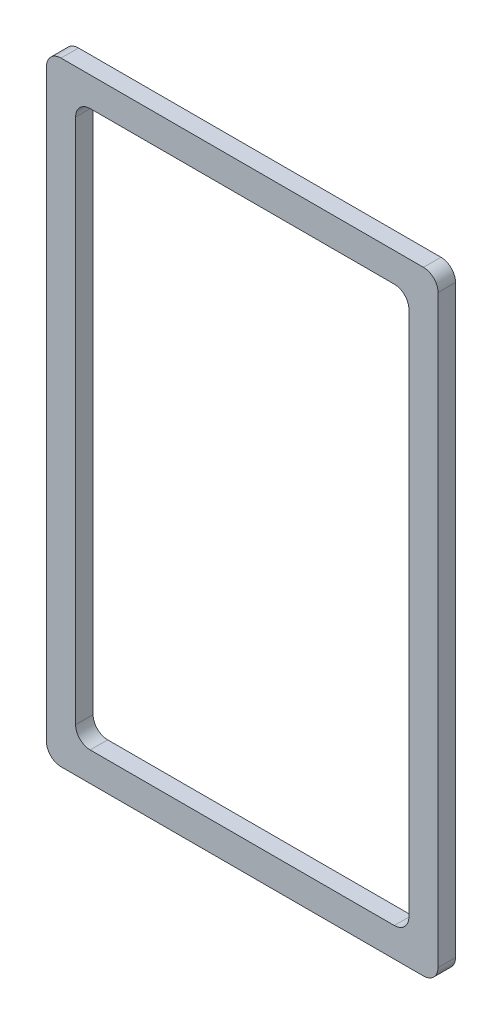
ISO-10303-21;
HEADER;
FILE_DESCRIPTION(('STEP AP214'),'2;1');
FILE_NAME('part.step','',(''),(''),'','','');
FILE_SCHEMA(('AUTOMOTIVE_DESIGN { 1 0 10303 214 1 1 1 1 }'));
ENDSEC;
DATA;
#1=APPLICATION_CONTEXT('core data for automotive mechanical design processes');
#2=APPLICATION_PROTOCOL_DEFINITION('international standard','automotive_design',2000,#1);
#3=PRODUCT_CONTEXT('',#1,'mechanical');
#4=PRODUCT('Part','Part','',(#3));
#5=PRODUCT_RELATED_PRODUCT_CATEGORY('part','',(#4));
#6=PRODUCT_DEFINITION_FORMATION('','',#4);
#7=PRODUCT_DEFINITION_CONTEXT('part definition',#1,'design');
#8=PRODUCT_DEFINITION('design','',#6,#7);
#9=PRODUCT_DEFINITION_SHAPE('','',#8);
#10=(LENGTH_UNIT() NAMED_UNIT(*) SI_UNIT(.MILLI.,.METRE.));
#11=(NAMED_UNIT(*) PLANE_ANGLE_UNIT() SI_UNIT($,.RADIAN.));
#12=(NAMED_UNIT(*) SI_UNIT($,.STERADIAN.) SOLID_ANGLE_UNIT());
#13=UNCERTAINTY_MEASURE_WITH_UNIT(LENGTH_MEASURE(1.E-05),#10,'distance_accuracy_value','');
#14=(GEOMETRIC_REPRESENTATION_CONTEXT(3) GLOBAL_UNCERTAINTY_ASSIGNED_CONTEXT((#13)) GLOBAL_UNIT_ASSIGNED_CONTEXT((#10,
#11,#12)) REPRESENTATION_CONTEXT('',''));
#15=CARTESIAN_POINT('',(0.,0.,0.));
#16=DIRECTION('',(0.,0.,1.));
#17=DIRECTION('',(1.,0.,0.));
#18=AXIS2_PLACEMENT_3D('',#15,#16,#17);
#19=CARTESIAN_POINT('',(2.5,2.5,3.));
#20=DIRECTION('',(0.,0.,1.));
#21=DIRECTION('',(1.,0.,0.));
#22=AXIS2_PLACEMENT_3D('',#19,#20,#21);
#23=PLANE('',#22);
#24=CARTESIAN_POINT('',(2.5,2.5,3.));
#25=DIRECTION('',(0.,0.,1.));
#26=DIRECTION('',(1.,0.,0.));
#27=AXIS2_PLACEMENT_3D('',#24,#25,#26);
#28=CIRCLE('',#27,2.5);
#29=CARTESIAN_POINT('',(0.,2.50000000000002,3.));
#30=VERTEX_POINT('',#29);
#31=CARTESIAN_POINT('',(2.50000000000002,0.,3.));
#32=VERTEX_POINT('',#31);
#33=EDGE_CURVE('E211',#30,#32,#28,.T.);
#34=ORIENTED_EDGE('',*,*,#33,.T.);
#35=DIRECTION('',(1.,0.,0.));
#36=VECTOR('',#35,1.);
#37=CARTESIAN_POINT('',(2.50000000000002,0.,3.));
#38=LINE('',#37,#36);
#39=CARTESIAN_POINT('',(64.6502,0.,3.));
#40=VERTEX_POINT('',#39);
#41=EDGE_CURVE('E214',#32,#40,#38,.T.);
#42=ORIENTED_EDGE('',*,*,#41,.T.);
#43=CARTESIAN_POINT('',(64.6502,2.5,3.));
#44=DIRECTION('',(0.,0.,1.));
#45=DIRECTION('',(1.,0.,0.));
#46=AXIS2_PLACEMENT_3D('',#43,#44,#45);
#47=CIRCLE('',#46,2.5);
#48=CARTESIAN_POINT('',(67.1502,2.50000000000002,3.));
#49=VERTEX_POINT('',#48);
#50=EDGE_CURVE('E217',#40,#49,#47,.T.);
#51=ORIENTED_EDGE('',*,*,#50,.T.);
#52=DIRECTION('',(0.,1.,0.));
#53=VECTOR('',#52,1.);
#54=CARTESIAN_POINT('',(67.1502,2.50000000000002,3.));
#55=LINE('',#54,#53);
#56=CARTESIAN_POINT('',(67.1502,102.7498,3.));
#57=VERTEX_POINT('',#56);
#58=EDGE_CURVE('E219',#49,#57,#55,.T.);
#59=ORIENTED_EDGE('',*,*,#58,.T.);
#60=CARTESIAN_POINT('',(64.6502,102.7498,3.));
#61=DIRECTION('',(0.,0.,1.));
#62=DIRECTION('',(1.,0.,0.));
#63=AXIS2_PLACEMENT_3D('',#60,#61,#62);
#64=CIRCLE('',#63,2.5);
#65=CARTESIAN_POINT('',(64.6502,105.2498,3.));
#66=VERTEX_POINT('',#65);
#67=EDGE_CURVE('E221',#57,#66,#64,.T.);
#68=ORIENTED_EDGE('',*,*,#67,.T.);
#69=DIRECTION('',(-1.,0.,0.));
#70=VECTOR('',#69,1.);
#71=CARTESIAN_POINT('',(2.50000000000002,105.2498,3.));
#72=LINE('',#71,#70);
#73=CARTESIAN_POINT('',(2.50000000000002,105.2498,3.));
#74=VERTEX_POINT('',#73);
#75=EDGE_CURVE('E223',#66,#74,#72,.T.);
#76=ORIENTED_EDGE('',*,*,#75,.T.);
#77=CARTESIAN_POINT('',(2.5,102.7498,3.));
#78=DIRECTION('',(0.,0.,1.));
#79=DIRECTION('',(1.,0.,0.));
#80=AXIS2_PLACEMENT_3D('',#77,#78,#79);
#81=CIRCLE('',#80,2.5);
#82=CARTESIAN_POINT('',(0.,102.7498,3.));
#83=VERTEX_POINT('',#82);
#84=EDGE_CURVE('E225',#74,#83,#81,.T.);
#85=ORIENTED_EDGE('',*,*,#84,.T.);
#86=DIRECTION('',(0.,-1.,0.));
#87=VECTOR('',#86,1.);
#88=CARTESIAN_POINT('',(0.,2.50000000000002,3.));
#89=LINE('',#88,#87);
#90=EDGE_CURVE('E227',#83,#30,#89,.T.);
#91=ORIENTED_EDGE('',*,*,#90,.T.);
#92=EDGE_LOOP('',(#34,#42,#51,#59,#68,#76,#85,#91));
#93=FACE_BOUND('',#92,.T.);
#94=DIRECTION('',(0.,1.,0.));
#95=VECTOR('',#94,1.);
#96=CARTESIAN_POINT('',(62.1502,97.7498,3.));
#97=LINE('',#96,#95);
#98=CARTESIAN_POINT('',(62.1502,7.50000000000002,3.));
#99=VERTEX_POINT('',#98);
#100=CARTESIAN_POINT('',(62.1502,97.7498,3.));
#101=VERTEX_POINT('',#100);
#102=EDGE_CURVE('E154',#99,#101,#97,.T.);
#103=ORIENTED_EDGE('',*,*,#102,.F.);
#104=CARTESIAN_POINT('',(59.6502,7.5,3.));
#105=DIRECTION('',(0.,0.,1.));
#106=DIRECTION('',(1.,0.,0.));
#107=AXIS2_PLACEMENT_3D('',#104,#105,#106);
#108=CIRCLE('',#107,2.5);
#109=CARTESIAN_POINT('',(59.6502,5.,3.));
#110=VERTEX_POINT('',#109);
#111=EDGE_CURVE('E146',#110,#99,#108,.T.);
#112=ORIENTED_EDGE('',*,*,#111,.F.);
#113=DIRECTION('',(1.,0.,0.));
#114=VECTOR('',#113,1.);
#115=CARTESIAN_POINT('',(7.50000000000002,5.,3.));
#116=LINE('',#115,#114);
#117=CARTESIAN_POINT('',(7.50000000000002,5.,3.));
#118=VERTEX_POINT('',#117);
#119=EDGE_CURVE('E179',#118,#110,#116,.T.);
#120=ORIENTED_EDGE('',*,*,#119,.F.);
#121=CARTESIAN_POINT('',(7.5,7.5,3.));
#122=DIRECTION('',(0.,0.,1.));
#123=DIRECTION('',(-1.,0.,0.));
#124=AXIS2_PLACEMENT_3D('',#121,#122,#123);
#125=CIRCLE('',#124,2.5);
#126=CARTESIAN_POINT('',(5.,7.5,3.));
#127=VERTEX_POINT('',#126);
#128=EDGE_CURVE('E177',#127,#118,#125,.T.);
#129=ORIENTED_EDGE('',*,*,#128,.F.);
#130=DIRECTION('',(0.,-1.,0.));
#131=VECTOR('',#130,1.);
#132=CARTESIAN_POINT('',(5.,97.7498,3.));
#133=LINE('',#132,#131);
#134=CARTESIAN_POINT('',(5.,97.7498,3.));
#135=VERTEX_POINT('',#134);
#136=EDGE_CURVE('E175',#135,#127,#133,.T.);
#137=ORIENTED_EDGE('',*,*,#136,.F.);
#138=CARTESIAN_POINT('',(7.5,97.7498,3.));
#139=DIRECTION('',(0.,0.,1.));
#140=DIRECTION('',(1.,0.,0.));
#141=AXIS2_PLACEMENT_3D('',#138,#139,#140);
#142=CIRCLE('',#141,2.5);
#143=CARTESIAN_POINT('',(7.50000000000002,100.2498,3.));
#144=VERTEX_POINT('',#143);
#145=EDGE_CURVE('E173',#144,#135,#142,.T.);
#146=ORIENTED_EDGE('',*,*,#145,.F.);
#147=DIRECTION('',(-1.,0.,0.));
#148=VECTOR('',#147,1.);
#149=CARTESIAN_POINT('',(7.50000000000002,100.2498,3.));
#150=LINE('',#149,#148);
#151=CARTESIAN_POINT('',(59.6502,100.2498,3.));
#152=VERTEX_POINT('',#151);
#153=EDGE_CURVE('E169',#152,#144,#150,.T.);
#154=ORIENTED_EDGE('',*,*,#153,.F.);
#155=CARTESIAN_POINT('',(59.6502,97.7498,3.));
#156=DIRECTION('',(0.,0.,1.));
#157=DIRECTION('',(1.,0.,0.));
#158=AXIS2_PLACEMENT_3D('',#155,#156,#157);
#159=CIRCLE('',#158,2.5);
#160=EDGE_CURVE('E167',#101,#152,#159,.T.);
#161=ORIENTED_EDGE('',*,*,#160,.F.);
#162=EDGE_LOOP('',(#103,#112,#120,#129,#137,#146,#154,#161));
#163=FACE_BOUND('',#162,.T.);
#164=ADVANCED_FACE('F33',(#93,#163),#23,.T.);
#165=CARTESIAN_POINT('',(2.5,2.5,0.));
#166=DIRECTION('',(0.,0.,1.));
#167=DIRECTION('',(1.,0.,0.));
#168=AXIS2_PLACEMENT_3D('',#165,#166,#167);
#169=PLANE('',#168);
#170=CARTESIAN_POINT('',(2.5,2.5,0.));
#171=DIRECTION('',(0.,0.,1.));
#172=DIRECTION('',(1.,0.,0.));
#173=AXIS2_PLACEMENT_3D('',#170,#171,#172);
#174=CIRCLE('',#173,2.5);
#175=CARTESIAN_POINT('',(0.,2.50000000000002,0.));
#176=VERTEX_POINT('',#175);
#177=CARTESIAN_POINT('',(2.50000000000002,0.,0.));
#178=VERTEX_POINT('',#177);
#179=EDGE_CURVE('E162',#176,#178,#174,.T.);
#180=ORIENTED_EDGE('',*,*,#179,.F.);
#181=DIRECTION('',(0.,-1.,0.));
#182=VECTOR('',#181,1.);
#183=CARTESIAN_POINT('',(0.,2.50000000000002,0.));
#184=LINE('',#183,#182);
#185=CARTESIAN_POINT('',(0.,102.7498,0.));
#186=VERTEX_POINT('',#185);
#187=EDGE_CURVE('E215',#186,#176,#184,.T.);
#188=ORIENTED_EDGE('',*,*,#187,.F.);
#189=CARTESIAN_POINT('',(2.5,102.7498,0.));
#190=DIRECTION('',(0.,0.,1.));
#191=DIRECTION('',(1.,0.,0.));
#192=AXIS2_PLACEMENT_3D('',#189,#190,#191);
#193=CIRCLE('',#192,2.5);
#194=CARTESIAN_POINT('',(2.50000000000002,105.2498,0.));
#195=VERTEX_POINT('',#194);
#196=EDGE_CURVE('E242',#195,#186,#193,.T.);
#197=ORIENTED_EDGE('',*,*,#196,.F.);
#198=DIRECTION('',(-1.,0.,0.));
#199=VECTOR('',#198,1.);
#200=CARTESIAN_POINT('',(2.50000000000002,105.2498,0.));
#201=LINE('',#200,#199);
#202=CARTESIAN_POINT('',(64.6502,105.2498,0.));
#203=VERTEX_POINT('',#202);
#204=EDGE_CURVE('E240',#203,#195,#201,.T.);
#205=ORIENTED_EDGE('',*,*,#204,.F.);
#206=CARTESIAN_POINT('',(64.6502,102.7498,0.));
#207=DIRECTION('',(0.,0.,1.));
#208=DIRECTION('',(1.,0.,0.));
#209=AXIS2_PLACEMENT_3D('',#206,#207,#208);
#210=CIRCLE('',#209,2.5);
#211=CARTESIAN_POINT('',(67.1502,102.7498,0.));
#212=VERTEX_POINT('',#211);
#213=EDGE_CURVE('E238',#212,#203,#210,.T.);
#214=ORIENTED_EDGE('',*,*,#213,.F.);
#215=DIRECTION('',(0.,1.,0.));
#216=VECTOR('',#215,1.);
#217=CARTESIAN_POINT('',(67.1502,2.50000000000002,0.));
#218=LINE('',#217,#216);
#219=CARTESIAN_POINT('',(67.1502,2.50000000000002,0.));
#220=VERTEX_POINT('',#219);
#221=EDGE_CURVE('E236',#220,#212,#218,.T.);
#222=ORIENTED_EDGE('',*,*,#221,.F.);
#223=CARTESIAN_POINT('',(64.6502,2.5,0.));
#224=DIRECTION('',(0.,0.,1.));
#225=DIRECTION('',(1.,0.,0.));
#226=AXIS2_PLACEMENT_3D('',#223,#224,#225);
#227=CIRCLE('',#226,2.5);
#228=CARTESIAN_POINT('',(64.6502,0.,0.));
#229=VERTEX_POINT('',#228);
#230=EDGE_CURVE('E234',#229,#220,#227,.T.);
#231=ORIENTED_EDGE('',*,*,#230,.F.);
#232=DIRECTION('',(1.,0.,0.));
#233=VECTOR('',#232,1.);
#234=CARTESIAN_POINT('',(2.50000000000002,0.,0.));
#235=LINE('',#234,#233);
#236=EDGE_CURVE('E232',#178,#229,#235,.T.);
#237=ORIENTED_EDGE('',*,*,#236,.F.);
#238=EDGE_LOOP('',(#180,#188,#197,#205,#214,#222,#231,#237));
#239=FACE_BOUND('',#238,.T.);
#240=CARTESIAN_POINT('',(59.6502,7.5,0.));
#241=DIRECTION('',(0.,0.,1.));
#242=DIRECTION('',(1.,0.,0.));
#243=AXIS2_PLACEMENT_3D('',#240,#241,#242);
#244=CIRCLE('',#243,2.5);
#245=CARTESIAN_POINT('',(59.6502,5.,0.));
#246=VERTEX_POINT('',#245);
#247=CARTESIAN_POINT('',(62.1502,7.50000000000002,0.));
#248=VERTEX_POINT('',#247);
#249=EDGE_CURVE('E56',#246,#248,#244,.T.);
#250=ORIENTED_EDGE('',*,*,#249,.T.);
#251=DIRECTION('',(0.,1.,0.));
#252=VECTOR('',#251,1.);
#253=CARTESIAN_POINT('',(62.1502,97.7498,0.));
#254=LINE('',#253,#252);
#255=CARTESIAN_POINT('',(62.1502,97.7498,0.));
#256=VERTEX_POINT('',#255);
#257=EDGE_CURVE('E161',#248,#256,#254,.T.);
#258=ORIENTED_EDGE('',*,*,#257,.T.);
#259=CARTESIAN_POINT('',(59.6502,97.7498,0.));
#260=DIRECTION('',(0.,0.,1.));
#261=DIRECTION('',(1.,0.,0.));
#262=AXIS2_PLACEMENT_3D('',#259,#260,#261);
#263=CIRCLE('',#262,2.5);
#264=CARTESIAN_POINT('',(59.6502,100.2498,0.));
#265=VERTEX_POINT('',#264);
#266=EDGE_CURVE('E183',#256,#265,#263,.T.);
#267=ORIENTED_EDGE('',*,*,#266,.T.);
#268=DIRECTION('',(-1.,0.,0.));
#269=VECTOR('',#268,1.);
#270=CARTESIAN_POINT('',(7.50000000000002,100.2498,0.));
#271=LINE('',#270,#269);
#272=CARTESIAN_POINT('',(7.50000000000002,100.2498,0.));
#273=VERTEX_POINT('',#272);
#274=EDGE_CURVE('E186',#265,#273,#271,.T.);
#275=ORIENTED_EDGE('',*,*,#274,.T.);
#276=CARTESIAN_POINT('',(7.5,97.7498,0.));
#277=DIRECTION('',(0.,0.,1.));
#278=DIRECTION('',(1.,0.,0.));
#279=AXIS2_PLACEMENT_3D('',#276,#277,#278);
#280=CIRCLE('',#279,2.5);
#281=CARTESIAN_POINT('',(5.,97.7498,0.));
#282=VERTEX_POINT('',#281);
#283=EDGE_CURVE('E189',#273,#282,#280,.T.);
#284=ORIENTED_EDGE('',*,*,#283,.T.);
#285=DIRECTION('',(0.,-1.,0.));
#286=VECTOR('',#285,1.);
#287=CARTESIAN_POINT('',(5.,97.7498,0.));
#288=LINE('',#287,#286);
#289=CARTESIAN_POINT('',(5.,7.5,0.));
#290=VERTEX_POINT('',#289);
#291=EDGE_CURVE('E192',#282,#290,#288,.T.);
#292=ORIENTED_EDGE('',*,*,#291,.T.);
#293=CARTESIAN_POINT('',(7.5,7.5,0.));
#294=DIRECTION('',(0.,0.,1.));
#295=DIRECTION('',(-1.,0.,0.));
#296=AXIS2_PLACEMENT_3D('',#293,#294,#295);
#297=CIRCLE('',#296,2.5);
#298=CARTESIAN_POINT('',(7.50000000000002,5.,0.));
#299=VERTEX_POINT('',#298);
#300=EDGE_CURVE('E195',#290,#299,#297,.T.);
#301=ORIENTED_EDGE('',*,*,#300,.T.);
#302=DIRECTION('',(1.,0.,0.));
#303=VECTOR('',#302,1.);
#304=CARTESIAN_POINT('',(7.50000000000002,5.,0.));
#305=LINE('',#304,#303);
#306=EDGE_CURVE('E155',#299,#246,#305,.T.);
#307=ORIENTED_EDGE('',*,*,#306,.T.);
#308=EDGE_LOOP('',(#250,#258,#267,#275,#284,#292,#301,#307));
#309=FACE_BOUND('',#308,.T.);
#310=ADVANCED_FACE('F272',(#239,#309),#169,.F.);
#311=CARTESIAN_POINT('',(2.5,2.5,3.));
#312=DIRECTION('',(0.,0.,-1.));
#313=DIRECTION('',(-1.,0.,0.));
#314=AXIS2_PLACEMENT_3D('',#311,#312,#313);
#315=CYLINDRICAL_SURFACE('',#314,2.5);
#316=ORIENTED_EDGE('',*,*,#179,.T.);
#317=DIRECTION('',(0.,0.,-1.));
#318=VECTOR('',#317,1.);
#319=CARTESIAN_POINT('',(2.50000000000002,0.,3.));
#320=LINE('',#319,#318);
#321=EDGE_CURVE('E11',#32,#178,#320,.T.);
#322=ORIENTED_EDGE('',*,*,#321,.F.);
#323=ORIENTED_EDGE('',*,*,#33,.F.);
#324=DIRECTION('',(0.,0.,-1.));
#325=VECTOR('',#324,1.);
#326=CARTESIAN_POINT('',(0.,2.50000000000002,3.));
#327=LINE('',#326,#325);
#328=EDGE_CURVE('E229',#30,#176,#327,.T.);
#329=ORIENTED_EDGE('',*,*,#328,.T.);
#330=EDGE_LOOP('',(#316,#322,#323,#329));
#331=FACE_BOUND('',#330,.T.);
#332=ADVANCED_FACE('F35',(#331),#315,.T.);
#333=CARTESIAN_POINT('',(2.50000000000002,0.,3.));
#334=DIRECTION('',(0.,1.,0.));
#335=DIRECTION('',(0.,0.,1.));
#336=AXIS2_PLACEMENT_3D('',#333,#334,#335);
#337=PLANE('',#336);
#338=ORIENTED_EDGE('',*,*,#236,.T.);
#339=DIRECTION('',(0.,0.,-1.));
#340=VECTOR('',#339,1.);
#341=CARTESIAN_POINT('',(64.6502,0.,3.));
#342=LINE('',#341,#340);
#343=EDGE_CURVE('E41',#40,#229,#342,.T.);
#344=ORIENTED_EDGE('',*,*,#343,.F.);
#345=ORIENTED_EDGE('',*,*,#41,.F.);
#346=ORIENTED_EDGE('',*,*,#321,.T.);
#347=EDGE_LOOP('',(#338,#344,#345,#346));
#348=FACE_BOUND('',#347,.T.);
#349=ADVANCED_FACE('F289',(#348),#337,.F.);
#350=CARTESIAN_POINT('',(64.6502,2.5,3.));
#351=DIRECTION('',(0.,0.,-1.));
#352=DIRECTION('',(-1.,0.,0.));
#353=AXIS2_PLACEMENT_3D('',#350,#351,#352);
#354=CYLINDRICAL_SURFACE('',#353,2.5);
#355=ORIENTED_EDGE('',*,*,#230,.T.);
#356=DIRECTION('',(0.,0.,-1.));
#357=VECTOR('',#356,1.);
#358=CARTESIAN_POINT('',(67.1502,2.50000000000002,3.));
#359=LINE('',#358,#357);
#360=EDGE_CURVE('E259',#49,#220,#359,.T.);
#361=ORIENTED_EDGE('',*,*,#360,.F.);
#362=ORIENTED_EDGE('',*,*,#50,.F.);
#363=ORIENTED_EDGE('',*,*,#343,.T.);
#364=EDGE_LOOP('',(#355,#361,#362,#363));
#365=FACE_BOUND('',#364,.T.);
#366=ADVANCED_FACE('F266',(#365),#354,.T.);
#367=CARTESIAN_POINT('',(67.1502,2.50000000000002,3.));
#368=DIRECTION('',(-1.,0.,0.));
#369=DIRECTION('',(0.,0.,1.));
#370=AXIS2_PLACEMENT_3D('',#367,#368,#369);
#371=PLANE('',#370);
#372=ORIENTED_EDGE('',*,*,#221,.T.);
#373=DIRECTION('',(0.,0.,-1.));
#374=VECTOR('',#373,1.);
#375=CARTESIAN_POINT('',(67.1502,102.7498,3.));
#376=LINE('',#375,#374);
#377=EDGE_CURVE('E256',#57,#212,#376,.T.);
#378=ORIENTED_EDGE('',*,*,#377,.F.);
#379=ORIENTED_EDGE('',*,*,#58,.F.);
#380=ORIENTED_EDGE('',*,*,#360,.T.);
#381=EDGE_LOOP('',(#372,#378,#379,#380));
#382=FACE_BOUND('',#381,.T.);
#383=ADVANCED_FACE('F278',(#382),#371,.F.);
#384=CARTESIAN_POINT('',(64.6502,102.7498,3.));
#385=DIRECTION('',(0.,0.,-1.));
#386=DIRECTION('',(-1.,0.,0.));
#387=AXIS2_PLACEMENT_3D('',#384,#385,#386);
#388=CYLINDRICAL_SURFACE('',#387,2.5);
#389=ORIENTED_EDGE('',*,*,#213,.T.);
#390=DIRECTION('',(0.,0.,-1.));
#391=VECTOR('',#390,1.);
#392=CARTESIAN_POINT('',(64.6502,105.2498,3.));
#393=LINE('',#392,#391);
#394=EDGE_CURVE('E253',#66,#203,#393,.T.);
#395=ORIENTED_EDGE('',*,*,#394,.F.);
#396=ORIENTED_EDGE('',*,*,#67,.F.);
#397=ORIENTED_EDGE('',*,*,#377,.T.);
#398=EDGE_LOOP('',(#389,#395,#396,#397));
#399=FACE_BOUND('',#398,.T.);
#400=ADVANCED_FACE('F282',(#399),#388,.T.);
#401=CARTESIAN_POINT('',(2.50000000000002,105.2498,3.));
#402=DIRECTION('',(0.,-1.,0.));
#403=DIRECTION('',(0.,0.,-1.));
#404=AXIS2_PLACEMENT_3D('',#401,#402,#403);
#405=PLANE('',#404);
#406=ORIENTED_EDGE('',*,*,#204,.T.);
#407=DIRECTION('',(0.,0.,-1.));
#408=VECTOR('',#407,1.);
#409=CARTESIAN_POINT('',(2.50000000000002,105.2498,3.));
#410=LINE('',#409,#408);
#411=EDGE_CURVE('E250',#74,#195,#410,.T.);
#412=ORIENTED_EDGE('',*,*,#411,.F.);
#413=ORIENTED_EDGE('',*,*,#75,.F.);
#414=ORIENTED_EDGE('',*,*,#394,.T.);
#415=EDGE_LOOP('',(#406,#412,#413,#414));
#416=FACE_BOUND('',#415,.T.);
#417=ADVANCED_FACE('F302',(#416),#405,.F.);
#418=CARTESIAN_POINT('',(2.5,102.7498,3.));
#419=DIRECTION('',(0.,0.,-1.));
#420=DIRECTION('',(-1.,0.,0.));
#421=AXIS2_PLACEMENT_3D('',#418,#419,#420);
#422=CYLINDRICAL_SURFACE('',#421,2.5);
#423=ORIENTED_EDGE('',*,*,#196,.T.);
#424=DIRECTION('',(0.,0.,-1.));
#425=VECTOR('',#424,1.);
#426=CARTESIAN_POINT('',(0.,102.7498,3.));
#427=LINE('',#426,#425);
#428=EDGE_CURVE('E247',#83,#186,#427,.T.);
#429=ORIENTED_EDGE('',*,*,#428,.F.);
#430=ORIENTED_EDGE('',*,*,#84,.F.);
#431=ORIENTED_EDGE('',*,*,#411,.T.);
#432=EDGE_LOOP('',(#423,#429,#430,#431));
#433=FACE_BOUND('',#432,.T.);
#434=ADVANCED_FACE('F300',(#433),#422,.T.);
#435=CARTESIAN_POINT('',(0.,2.50000000000002,3.));
#436=DIRECTION('',(1.,0.,0.));
#437=DIRECTION('',(0.,0.,-1.));
#438=AXIS2_PLACEMENT_3D('',#435,#436,#437);
#439=PLANE('',#438);
#440=ORIENTED_EDGE('',*,*,#187,.T.);
#441=ORIENTED_EDGE('',*,*,#328,.F.);
#442=ORIENTED_EDGE('',*,*,#90,.F.);
#443=ORIENTED_EDGE('',*,*,#428,.T.);
#444=EDGE_LOOP('',(#440,#441,#442,#443));
#445=FACE_BOUND('',#444,.T.);
#446=ADVANCED_FACE('F295',(#445),#439,.F.);
#447=CARTESIAN_POINT('',(59.6502,7.5,3.));
#448=DIRECTION('',(0.,0.,-1.));
#449=DIRECTION('',(-1.,0.,0.));
#450=AXIS2_PLACEMENT_3D('',#447,#448,#449);
#451=CYLINDRICAL_SURFACE('',#450,2.5);
#452=ORIENTED_EDGE('',*,*,#249,.F.);
#453=DIRECTION('',(0.,0.,-1.));
#454=VECTOR('',#453,1.);
#455=CARTESIAN_POINT('',(59.6502,5.,3.));
#456=LINE('',#455,#454);
#457=EDGE_CURVE('E150',#110,#246,#456,.T.);
#458=ORIENTED_EDGE('',*,*,#457,.F.);
#459=ORIENTED_EDGE('',*,*,#111,.T.);
#460=DIRECTION('',(0.,0.,-1.));
#461=VECTOR('',#460,1.);
#462=CARTESIAN_POINT('',(62.1502,7.50000000000002,3.));
#463=LINE('',#462,#461);
#464=EDGE_CURVE('E149',#99,#248,#463,.T.);
#465=ORIENTED_EDGE('',*,*,#464,.T.);
#466=EDGE_LOOP('',(#452,#458,#459,#465));
#467=FACE_BOUND('',#466,.T.);
#468=ADVANCED_FACE('F148',(#467),#451,.F.);
#469=CARTESIAN_POINT('',(62.1502,97.7498,3.));
#470=DIRECTION('',(-1.,0.,0.));
#471=DIRECTION('',(0.,0.,1.));
#472=AXIS2_PLACEMENT_3D('',#469,#470,#471);
#473=PLANE('',#472);
#474=ORIENTED_EDGE('',*,*,#257,.F.);
#475=ORIENTED_EDGE('',*,*,#464,.F.);
#476=ORIENTED_EDGE('',*,*,#102,.T.);
#477=DIRECTION('',(0.,0.,-1.));
#478=VECTOR('',#477,1.);
#479=CARTESIAN_POINT('',(62.1502,97.7498,3.));
#480=LINE('',#479,#478);
#481=EDGE_CURVE('E163',#101,#256,#480,.T.);
#482=ORIENTED_EDGE('',*,*,#481,.T.);
#483=EDGE_LOOP('',(#474,#475,#476,#482));
#484=FACE_BOUND('',#483,.T.);
#485=ADVANCED_FACE('F158',(#484),#473,.T.);
#486=CARTESIAN_POINT('',(59.6502,97.7498,3.));
#487=DIRECTION('',(0.,0.,-1.));
#488=DIRECTION('',(-1.,0.,0.));
#489=AXIS2_PLACEMENT_3D('',#486,#487,#488);
#490=CYLINDRICAL_SURFACE('',#489,2.5);
#491=ORIENTED_EDGE('',*,*,#266,.F.);
#492=ORIENTED_EDGE('',*,*,#481,.F.);
#493=ORIENTED_EDGE('',*,*,#160,.T.);
#494=DIRECTION('',(0.,0.,-1.));
#495=VECTOR('',#494,1.);
#496=CARTESIAN_POINT('',(59.6502,100.2498,3.));
#497=LINE('',#496,#495);
#498=EDGE_CURVE('E208',#152,#265,#497,.T.);
#499=ORIENTED_EDGE('',*,*,#498,.T.);
#500=EDGE_LOOP('',(#491,#492,#493,#499));
#501=FACE_BOUND('',#500,.T.);
#502=ADVANCED_FACE('F327',(#501),#490,.F.);
#503=CARTESIAN_POINT('',(7.50000000000002,100.2498,3.));
#504=DIRECTION('',(0.,-1.,0.));
#505=DIRECTION('',(0.,0.,-1.));
#506=AXIS2_PLACEMENT_3D('',#503,#504,#505);
#507=PLANE('',#506);
#508=ORIENTED_EDGE('',*,*,#274,.F.);
#509=ORIENTED_EDGE('',*,*,#498,.F.);
#510=ORIENTED_EDGE('',*,*,#153,.T.);
#511=DIRECTION('',(0.,0.,-1.));
#512=VECTOR('',#511,1.);
#513=CARTESIAN_POINT('',(7.50000000000002,100.2498,3.));
#514=LINE('',#513,#512);
#515=EDGE_CURVE('E206',#144,#273,#514,.T.);
#516=ORIENTED_EDGE('',*,*,#515,.T.);
#517=EDGE_LOOP('',(#508,#509,#510,#516));
#518=FACE_BOUND('',#517,.T.);
#519=ADVANCED_FACE('F331',(#518),#507,.T.);
#520=CARTESIAN_POINT('',(7.5,97.7498,3.));
#521=DIRECTION('',(0.,0.,-1.));
#522=DIRECTION('',(-1.,0.,0.));
#523=AXIS2_PLACEMENT_3D('',#520,#521,#522);
#524=CYLINDRICAL_SURFACE('',#523,2.5);
#525=ORIENTED_EDGE('',*,*,#283,.F.);
#526=ORIENTED_EDGE('',*,*,#515,.F.);
#527=ORIENTED_EDGE('',*,*,#145,.T.);
#528=DIRECTION('',(0.,0.,-1.));
#529=VECTOR('',#528,1.);
#530=CARTESIAN_POINT('',(5.,97.7498,3.));
#531=LINE('',#530,#529);
#532=EDGE_CURVE('E204',#135,#282,#531,.T.);
#533=ORIENTED_EDGE('',*,*,#532,.T.);
#534=EDGE_LOOP('',(#525,#526,#527,#533));
#535=FACE_BOUND('',#534,.T.);
#536=ADVANCED_FACE('F337',(#535),#524,.F.);
#537=CARTESIAN_POINT('',(5.,97.7498,3.));
#538=DIRECTION('',(1.,0.,0.));
#539=DIRECTION('',(0.,0.,-1.));
#540=AXIS2_PLACEMENT_3D('',#537,#538,#539);
#541=PLANE('',#540);
#542=ORIENTED_EDGE('',*,*,#291,.F.);
#543=ORIENTED_EDGE('',*,*,#532,.F.);
#544=ORIENTED_EDGE('',*,*,#136,.T.);
#545=DIRECTION('',(0.,0.,-1.));
#546=VECTOR('',#545,1.);
#547=CARTESIAN_POINT('',(5.,7.5,3.));
#548=LINE('',#547,#546);
#549=EDGE_CURVE('E202',#127,#290,#548,.T.);
#550=ORIENTED_EDGE('',*,*,#549,.T.);
#551=EDGE_LOOP('',(#542,#543,#544,#550));
#552=FACE_BOUND('',#551,.T.);
#553=ADVANCED_FACE('F341',(#552),#541,.T.);
#554=CARTESIAN_POINT('',(7.5,7.5,3.));
#555=DIRECTION('',(0.,0.,-1.));
#556=DIRECTION('',(-1.,0.,0.));
#557=AXIS2_PLACEMENT_3D('',#554,#555,#556);
#558=CYLINDRICAL_SURFACE('',#557,2.5);
#559=ORIENTED_EDGE('',*,*,#300,.F.);
#560=ORIENTED_EDGE('',*,*,#549,.F.);
#561=ORIENTED_EDGE('',*,*,#128,.T.);
#562=DIRECTION('',(0.,0.,-1.));
#563=VECTOR('',#562,1.);
#564=CARTESIAN_POINT('',(7.50000000000002,5.,3.));
#565=LINE('',#564,#563);
#566=EDGE_CURVE('E48',#118,#299,#565,.T.);
#567=ORIENTED_EDGE('',*,*,#566,.T.);
#568=EDGE_LOOP('',(#559,#560,#561,#567));
#569=FACE_BOUND('',#568,.T.);
#570=ADVANCED_FACE('F345',(#569),#558,.F.);
#571=CARTESIAN_POINT('',(7.50000000000002,5.,3.));
#572=DIRECTION('',(0.,1.,0.));
#573=DIRECTION('',(0.,0.,1.));
#574=AXIS2_PLACEMENT_3D('',#571,#572,#573);
#575=PLANE('',#574);
#576=ORIENTED_EDGE('',*,*,#306,.F.);
#577=ORIENTED_EDGE('',*,*,#566,.F.);
#578=ORIENTED_EDGE('',*,*,#119,.T.);
#579=ORIENTED_EDGE('',*,*,#457,.T.);
#580=EDGE_LOOP('',(#576,#577,#578,#579));
#581=FACE_BOUND('',#580,.T.);
#582=ADVANCED_FACE('F349',(#581),#575,.T.);
#583=CLOSED_SHELL('',(#164,#310,#332,#349,#366,#383,#400,#417,#434,#446,#468,#485,#502,#519,
#536,#553,#570,#582));
#584=MANIFOLD_SOLID_BREP('B2',#583);
#585=ADVANCED_BREP_SHAPE_REPRESENTATION('',(#18,#584),#14);
#586=SHAPE_DEFINITION_REPRESENTATION(#9,#585);
ENDSEC;
END-ISO-10303-21;
